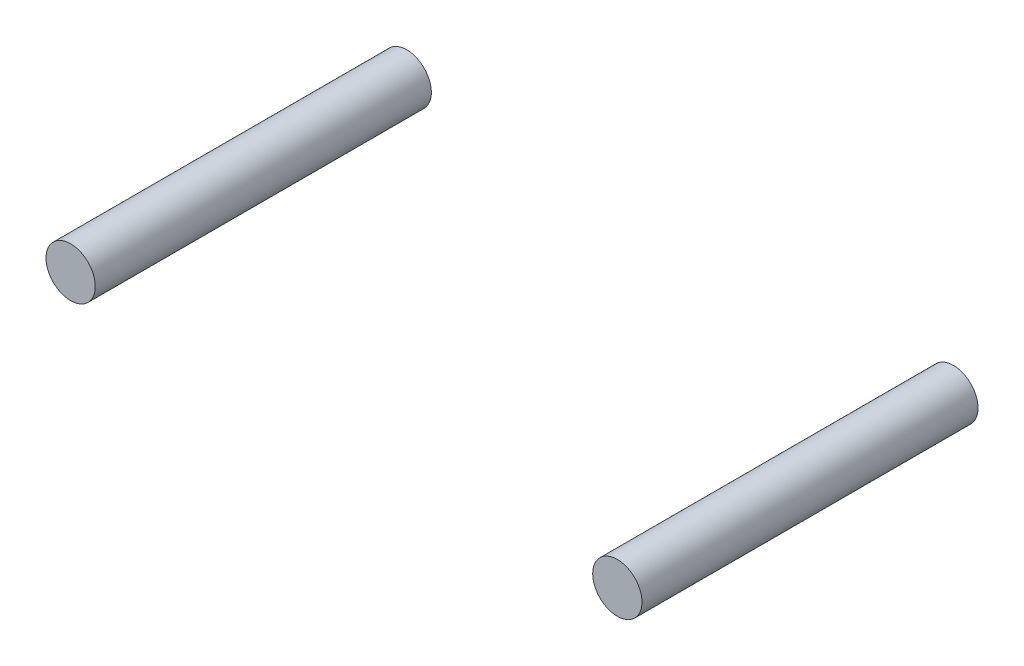
ISO-10303-21;
HEADER;
FILE_DESCRIPTION(('STEP AP214'),'2;1');
FILE_NAME('part.step','',(''),(''),'','','');
FILE_SCHEMA(('AUTOMOTIVE_DESIGN { 1 0 10303 214 1 1 1 1 }'));
ENDSEC;
DATA;
#1=APPLICATION_CONTEXT('core data for automotive mechanical design processes');
#2=APPLICATION_PROTOCOL_DEFINITION('international standard','automotive_design',2000,#1);
#3=PRODUCT_CONTEXT('',#1,'mechanical');
#4=PRODUCT('Part','Part','',(#3));
#5=PRODUCT_RELATED_PRODUCT_CATEGORY('part','',(#4));
#6=PRODUCT_DEFINITION_FORMATION('','',#4);
#7=PRODUCT_DEFINITION_CONTEXT('part definition',#1,'design');
#8=PRODUCT_DEFINITION('design','',#6,#7);
#9=PRODUCT_DEFINITION_SHAPE('','',#8);
#10=(LENGTH_UNIT() NAMED_UNIT(*) SI_UNIT(.MILLI.,.METRE.));
#11=(NAMED_UNIT(*) PLANE_ANGLE_UNIT() SI_UNIT($,.RADIAN.));
#12=(NAMED_UNIT(*) SI_UNIT($,.STERADIAN.) SOLID_ANGLE_UNIT());
#13=UNCERTAINTY_MEASURE_WITH_UNIT(LENGTH_MEASURE(1.E-05),#10,'distance_accuracy_value','');
#14=(GEOMETRIC_REPRESENTATION_CONTEXT(3) GLOBAL_UNCERTAINTY_ASSIGNED_CONTEXT((#13)) GLOBAL_UNIT_ASSIGNED_CONTEXT((#10,
#11,#12)) REPRESENTATION_CONTEXT('',''));
#15=CARTESIAN_POINT('',(0.,0.,0.));
#16=DIRECTION('',(0.,0.,1.));
#17=DIRECTION('',(1.,0.,0.));
#18=AXIS2_PLACEMENT_3D('',#15,#16,#17);
#19=CARTESIAN_POINT('',(5.1000025,2.540000000259E-06,0.));
#20=DIRECTION('',(0.,0.,-1.));
#21=DIRECTION('',(-1.,0.,0.));
#22=AXIS2_PLACEMENT_3D('',#19,#20,#21);
#23=PLANE('',#22);
#24=CARTESIAN_POINT('',(4.88000294,2.540000000259E-06,0.));
#25=DIRECTION('',(0.,0.,-1.));
#26=DIRECTION('',(-1.,0.,0.));
#27=AXIS2_PLACEMENT_3D('',#24,#25,#26);
#28=CIRCLE('',#27,0.21999956);
#29=CARTESIAN_POINT('',(4.66000338,2.540000000259E-06,0.));
#30=VERTEX_POINT('',#29);
#31=EDGE_CURVE('P0_E18',#30,#30,#28,.T.);
#32=ORIENTED_EDGE('',*,*,#31,.F.);
#33=EDGE_LOOP('',(#32));
#34=FACE_BOUND('',#33,.T.);
#35=ADVANCED_FACE('P0_F15',(#34),#23,.F.);
#36=CARTESIAN_POINT('',(5.1000025,2.540000000259E-06,-2.99999908));
#37=DIRECTION('',(0.,0.,-1.));
#38=DIRECTION('',(-1.,0.,0.));
#39=AXIS2_PLACEMENT_3D('',#36,#37,#38);
#40=PLANE('',#39);
#41=CARTESIAN_POINT('',(4.88000294,2.540000000259E-06,-2.99999908));
#42=DIRECTION('',(0.,0.,-1.));
#43=DIRECTION('',(-1.,0.,0.));
#44=AXIS2_PLACEMENT_3D('',#41,#42,#43);
#45=CIRCLE('',#44,0.21999956);
#46=CARTESIAN_POINT('',(4.66000338,2.540000000259E-06,-2.99999908));
#47=VERTEX_POINT('',#46);
#48=EDGE_CURVE('P0_E10',#47,#47,#45,.F.);
#49=ORIENTED_EDGE('',*,*,#48,.F.);
#50=EDGE_LOOP('',(#49));
#51=FACE_BOUND('',#50,.T.);
#52=ADVANCED_FACE('P0_F30',(#51),#40,.T.);
#53=CARTESIAN_POINT('',(4.88000294,2.540000000259E-06,-2.99999908));
#54=DIRECTION('',(0.,0.,-1.));
#55=DIRECTION('',(-1.,0.,0.));
#56=AXIS2_PLACEMENT_3D('',#53,#54,#55);
#57=CYLINDRICAL_SURFACE('',#56,0.21999956);
#58=ORIENTED_EDGE('',*,*,#48,.T.);
#59=EDGE_LOOP('',(#58));
#60=FACE_BOUND('',#59,.T.);
#61=ORIENTED_EDGE('',*,*,#31,.T.);
#62=EDGE_LOOP('',(#61));
#63=FACE_BOUND('',#62,.T.);
#64=ADVANCED_FACE('P0_F27',(#60,#63),#57,.T.);
#65=CLOSED_SHELL('',(#35,#52,#64));
#66=MANIFOLD_SOLID_BREP('P0_B1',#65);
#67=CARTESIAN_POINT('',(0.2200021,2.540000000259E-06,0.));
#68=DIRECTION('',(0.,0.,-1.));
#69=DIRECTION('',(-1.,0.,0.));
#70=AXIS2_PLACEMENT_3D('',#67,#68,#69);
#71=PLANE('',#70);
#72=CARTESIAN_POINT('',(2.54000000069268E-06,2.540000000259E-06,0.));
#73=DIRECTION('',(0.,0.,-1.));
#74=DIRECTION('',(-1.,0.,0.));
#75=AXIS2_PLACEMENT_3D('',#72,#73,#74);
#76=CIRCLE('',#75,0.21999956);
#77=CARTESIAN_POINT('',(-0.219997019999999,2.540000000259E-06,0.));
#78=VERTEX_POINT('',#77);
#79=EDGE_CURVE('P1_E18',#78,#78,#76,.T.);
#80=ORIENTED_EDGE('',*,*,#79,.F.);
#81=EDGE_LOOP('',(#80));
#82=FACE_BOUND('',#81,.T.);
#83=ADVANCED_FACE('P1_F15',(#82),#71,.F.);
#84=CARTESIAN_POINT('',(0.2200021,2.540000000259E-06,-2.99999908));
#85=DIRECTION('',(0.,0.,-1.));
#86=DIRECTION('',(-1.,0.,0.));
#87=AXIS2_PLACEMENT_3D('',#84,#85,#86);
#88=PLANE('',#87);
#89=CARTESIAN_POINT('',(2.54000000069268E-06,2.540000000259E-06,-2.99999908));
#90=DIRECTION('',(0.,0.,-1.));
#91=DIRECTION('',(-1.,0.,0.));
#92=AXIS2_PLACEMENT_3D('',#89,#90,#91);
#93=CIRCLE('',#92,0.21999956);
#94=CARTESIAN_POINT('',(-0.219997019999999,2.540000000259E-06,-2.99999908));
#95=VERTEX_POINT('',#94);
#96=EDGE_CURVE('P1_E10',#95,#95,#93,.F.);
#97=ORIENTED_EDGE('',*,*,#96,.F.);
#98=EDGE_LOOP('',(#97));
#99=FACE_BOUND('',#98,.T.);
#100=ADVANCED_FACE('P1_F30',(#99),#88,.T.);
#101=CARTESIAN_POINT('',(2.54000000069268E-06,2.540000000259E-06,-2.99999908));
#102=DIRECTION('',(0.,0.,-1.));
#103=DIRECTION('',(-1.,0.,0.));
#104=AXIS2_PLACEMENT_3D('',#101,#102,#103);
#105=CYLINDRICAL_SURFACE('',#104,0.21999956);
#106=ORIENTED_EDGE('',*,*,#96,.T.);
#107=EDGE_LOOP('',(#106));
#108=FACE_BOUND('',#107,.T.);
#109=ORIENTED_EDGE('',*,*,#79,.T.);
#110=EDGE_LOOP('',(#109));
#111=FACE_BOUND('',#110,.T.);
#112=ADVANCED_FACE('P1_F27',(#108,#111),#105,.T.);
#113=CLOSED_SHELL('',(#83,#100,#112));
#114=MANIFOLD_SOLID_BREP('P1_B1',#113);
#115=ADVANCED_BREP_SHAPE_REPRESENTATION('',(#18,#66,#114),#14);
#116=SHAPE_DEFINITION_REPRESENTATION(#9,#115);
ENDSEC;
END-ISO-10303-21;
